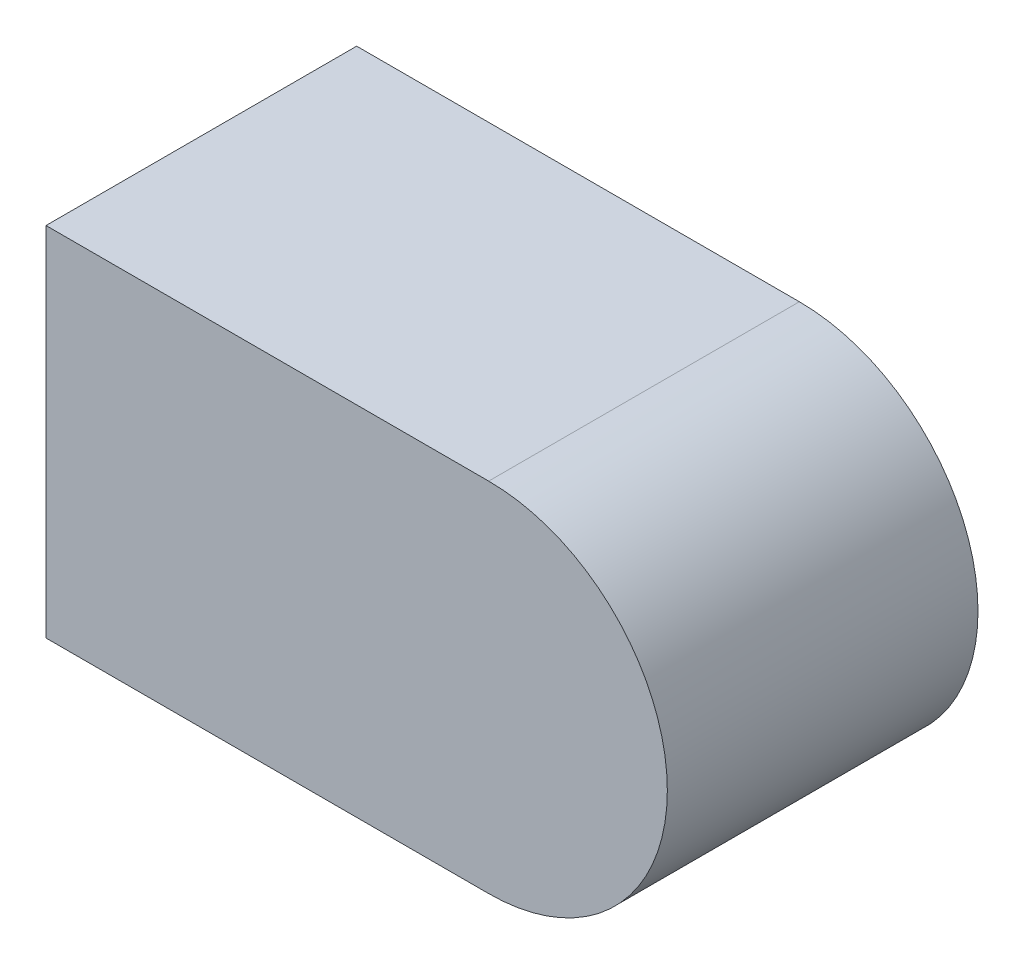
ISO-10303-21;
HEADER;
FILE_DESCRIPTION(('STEP AP214'),'2;1');
FILE_NAME('part.step','',(''),(''),'','','');
FILE_SCHEMA(('AUTOMOTIVE_DESIGN { 1 0 10303 214 1 1 1 1 }'));
ENDSEC;
DATA;
#1=APPLICATION_CONTEXT('core data for automotive mechanical design processes');
#2=APPLICATION_PROTOCOL_DEFINITION('international standard','automotive_design',2000,#1);
#3=PRODUCT_CONTEXT('',#1,'mechanical');
#4=PRODUCT('Part','Part','',(#3));
#5=PRODUCT_RELATED_PRODUCT_CATEGORY('part','',(#4));
#6=PRODUCT_DEFINITION_FORMATION('','',#4);
#7=PRODUCT_DEFINITION_CONTEXT('part definition',#1,'design');
#8=PRODUCT_DEFINITION('design','',#6,#7);
#9=PRODUCT_DEFINITION_SHAPE('','',#8);
#10=(LENGTH_UNIT() NAMED_UNIT(*) SI_UNIT(.MILLI.,.METRE.));
#11=(NAMED_UNIT(*) PLANE_ANGLE_UNIT() SI_UNIT($,.RADIAN.));
#12=(NAMED_UNIT(*) SI_UNIT($,.STERADIAN.) SOLID_ANGLE_UNIT());
#13=UNCERTAINTY_MEASURE_WITH_UNIT(LENGTH_MEASURE(1.E-05),#10,'distance_accuracy_value','');
#14=(GEOMETRIC_REPRESENTATION_CONTEXT(3) GLOBAL_UNCERTAINTY_ASSIGNED_CONTEXT((#13)) GLOBAL_UNIT_ASSIGNED_CONTEXT((#10,
#11,#12)) REPRESENTATION_CONTEXT('',''));
#15=CARTESIAN_POINT('',(0.,0.,0.));
#16=DIRECTION('',(0.,0.,1.));
#17=DIRECTION('',(1.,0.,0.));
#18=AXIS2_PLACEMENT_3D('',#15,#16,#17);
#19=CARTESIAN_POINT('',(-2.8335265642716,-2.25,0.));
#20=DIRECTION('',(0.,0.,1.));
#21=DIRECTION('',(1.,0.,0.));
#22=AXIS2_PLACEMENT_3D('',#19,#20,#21);
#23=PLANE('',#22);
#24=DIRECTION('',(0.,-1.,0.));
#25=VECTOR('',#24,1.);
#26=CARTESIAN_POINT('',(-3.,-2.135,0.));
#27=LINE('',#26,#25);
#28=CARTESIAN_POINT('',(-3.,-2.135,0.));
#29=VERTEX_POINT('',#28);
#30=CARTESIAN_POINT('',(-3.,-2.365,0.));
#31=VERTEX_POINT('',#30);
#32=EDGE_CURVE('E11',#29,#31,#27,.T.);
#33=ORIENTED_EDGE('',*,*,#32,.F.);
#34=DIRECTION('',(-1.,0.,0.));
#35=VECTOR('',#34,1.);
#36=CARTESIAN_POINT('',(-2.715,-2.135,0.));
#37=LINE('',#36,#35);
#38=CARTESIAN_POINT('',(-2.715,-2.135,0.));
#39=VERTEX_POINT('',#38);
#40=EDGE_CURVE('E24',#39,#29,#37,.T.);
#41=ORIENTED_EDGE('',*,*,#40,.F.);
#42=CARTESIAN_POINT('',(-2.715,-2.25,0.));
#43=DIRECTION('',(0.,0.,1.));
#44=DIRECTION('',(0.,-1.,0.));
#45=AXIS2_PLACEMENT_3D('',#42,#43,#44);
#46=CIRCLE('',#45,0.115);
#47=CARTESIAN_POINT('',(-2.715,-2.365,0.));
#48=VERTEX_POINT('',#47);
#49=EDGE_CURVE('E85',#48,#39,#46,.T.);
#50=ORIENTED_EDGE('',*,*,#49,.F.);
#51=DIRECTION('',(1.,0.,0.));
#52=VECTOR('',#51,1.);
#53=CARTESIAN_POINT('',(-3.,-2.365,0.));
#54=LINE('',#53,#52);
#55=EDGE_CURVE('E82',#31,#48,#54,.T.);
#56=ORIENTED_EDGE('',*,*,#55,.F.);
#57=EDGE_LOOP('',(#33,#41,#50,#56));
#58=FACE_BOUND('',#57,.T.);
#59=ADVANCED_FACE('F17',(#58),#23,.F.);
#60=CARTESIAN_POINT('',(-3.,-2.365,0.));
#61=DIRECTION('',(0.,-1.,0.));
#62=DIRECTION('',(1.,0.,0.));
#63=AXIS2_PLACEMENT_3D('',#60,#61,#62);
#64=PLANE('',#63);
#65=ORIENTED_EDGE('',*,*,#55,.T.);
#66=DIRECTION('',(0.,0.,1.));
#67=VECTOR('',#66,1.);
#68=CARTESIAN_POINT('',(-2.715,-2.365,0.));
#69=LINE('',#68,#67);
#70=CARTESIAN_POINT('',(-2.715,-2.365,0.2));
#71=VERTEX_POINT('',#70);
#72=EDGE_CURVE('E80',#48,#71,#69,.T.);
#73=ORIENTED_EDGE('',*,*,#72,.T.);
#74=DIRECTION('',(1.,0.,0.));
#75=VECTOR('',#74,1.);
#76=CARTESIAN_POINT('',(-3.,-2.365,0.2));
#77=LINE('',#76,#75);
#78=CARTESIAN_POINT('',(-3.,-2.365,0.2));
#79=VERTEX_POINT('',#78);
#80=EDGE_CURVE('E78',#79,#71,#77,.T.);
#81=ORIENTED_EDGE('',*,*,#80,.F.);
#82=DIRECTION('',(0.,0.,-1.));
#83=VECTOR('',#82,1.);
#84=CARTESIAN_POINT('',(-3.,-2.365,0.));
#85=LINE('',#84,#83);
#86=EDGE_CURVE('E71',#79,#31,#85,.T.);
#87=ORIENTED_EDGE('',*,*,#86,.T.);
#88=EDGE_LOOP('',(#65,#73,#81,#87));
#89=FACE_BOUND('',#88,.T.);
#90=ADVANCED_FACE('F91',(#89),#64,.T.);
#91=CARTESIAN_POINT('',(-2.715,-2.25,0.));
#92=DIRECTION('',(0.,0.,1.));
#93=DIRECTION('',(0.,-1.,0.));
#94=AXIS2_PLACEMENT_3D('',#91,#92,#93);
#95=CYLINDRICAL_SURFACE('',#94,0.115);
#96=ORIENTED_EDGE('',*,*,#49,.T.);
#97=DIRECTION('',(0.,0.,1.));
#98=VECTOR('',#97,1.);
#99=CARTESIAN_POINT('',(-2.715,-2.135,0.));
#100=LINE('',#99,#98);
#101=CARTESIAN_POINT('',(-2.715,-2.135,0.2));
#102=VERTEX_POINT('',#101);
#103=EDGE_CURVE('E75',#39,#102,#100,.T.);
#104=ORIENTED_EDGE('',*,*,#103,.T.);
#105=CARTESIAN_POINT('',(-2.715,-2.25,0.2));
#106=DIRECTION('',(0.,0.,1.));
#107=DIRECTION('',(0.,-1.,0.));
#108=AXIS2_PLACEMENT_3D('',#105,#106,#107);
#109=CIRCLE('',#108,0.115);
#110=EDGE_CURVE('E59',#71,#102,#109,.T.);
#111=ORIENTED_EDGE('',*,*,#110,.F.);
#112=ORIENTED_EDGE('',*,*,#72,.F.);
#113=EDGE_LOOP('',(#96,#104,#111,#112));
#114=FACE_BOUND('',#113,.T.);
#115=ADVANCED_FACE('F89',(#114),#95,.T.);
#116=CARTESIAN_POINT('',(-2.715,-2.135,0.));
#117=DIRECTION('',(0.,1.,0.));
#118=DIRECTION('',(-1.,0.,0.));
#119=AXIS2_PLACEMENT_3D('',#116,#117,#118);
#120=PLANE('',#119);
#121=ORIENTED_EDGE('',*,*,#40,.T.);
#122=DIRECTION('',(0.,0.,1.));
#123=VECTOR('',#122,1.);
#124=CARTESIAN_POINT('',(-3.,-2.135,0.));
#125=LINE('',#124,#123);
#126=CARTESIAN_POINT('',(-3.,-2.135,0.2));
#127=VERTEX_POINT('',#126);
#128=EDGE_CURVE('E53',#29,#127,#125,.T.);
#129=ORIENTED_EDGE('',*,*,#128,.T.);
#130=DIRECTION('',(-1.,0.,0.));
#131=VECTOR('',#130,1.);
#132=CARTESIAN_POINT('',(-2.715,-2.135,0.2));
#133=LINE('',#132,#131);
#134=EDGE_CURVE('E57',#102,#127,#133,.T.);
#135=ORIENTED_EDGE('',*,*,#134,.F.);
#136=ORIENTED_EDGE('',*,*,#103,.F.);
#137=EDGE_LOOP('',(#121,#129,#135,#136));
#138=FACE_BOUND('',#137,.T.);
#139=ADVANCED_FACE('F55',(#138),#120,.T.);
#140=CARTESIAN_POINT('',(-3.,3.,0.));
#141=DIRECTION('',(-1.,0.,0.));
#142=DIRECTION('',(0.,-1.,0.));
#143=AXIS2_PLACEMENT_3D('',#140,#141,#142);
#144=PLANE('',#143);
#145=ORIENTED_EDGE('',*,*,#86,.F.);
#146=DIRECTION('',(0.,-1.,0.));
#147=VECTOR('',#146,1.);
#148=CARTESIAN_POINT('',(-3.,0.375,0.2));
#149=LINE('',#148,#147);
#150=EDGE_CURVE('E66',#127,#79,#149,.T.);
#151=ORIENTED_EDGE('',*,*,#150,.F.);
#152=ORIENTED_EDGE('',*,*,#128,.F.);
#153=ORIENTED_EDGE('',*,*,#32,.T.);
#154=EDGE_LOOP('',(#145,#151,#152,#153));
#155=FACE_BOUND('',#154,.T.);
#156=ADVANCED_FACE('F69',(#155),#144,.T.);
#157=CARTESIAN_POINT('',(-2.8335240809167,-2.25,0.2));
#158=DIRECTION('',(0.,0.,1.));
#159=DIRECTION('',(1.,0.,0.));
#160=AXIS2_PLACEMENT_3D('',#157,#158,#159);
#161=PLANE('',#160);
#162=ORIENTED_EDGE('',*,*,#134,.T.);
#163=ORIENTED_EDGE('',*,*,#150,.T.);
#164=ORIENTED_EDGE('',*,*,#80,.T.);
#165=ORIENTED_EDGE('',*,*,#110,.T.);
#166=EDGE_LOOP('',(#162,#163,#164,#165));
#167=FACE_BOUND('',#166,.T.);
#168=ADVANCED_FACE('F64',(#167),#161,.T.);
#169=CLOSED_SHELL('',(#59,#90,#115,#139,#156,#168));
#170=MANIFOLD_SOLID_BREP('B1',#169);
#171=ADVANCED_BREP_SHAPE_REPRESENTATION('',(#18,#170),#14);
#172=SHAPE_DEFINITION_REPRESENTATION(#9,#171);
ENDSEC;
END-ISO-10303-21;
